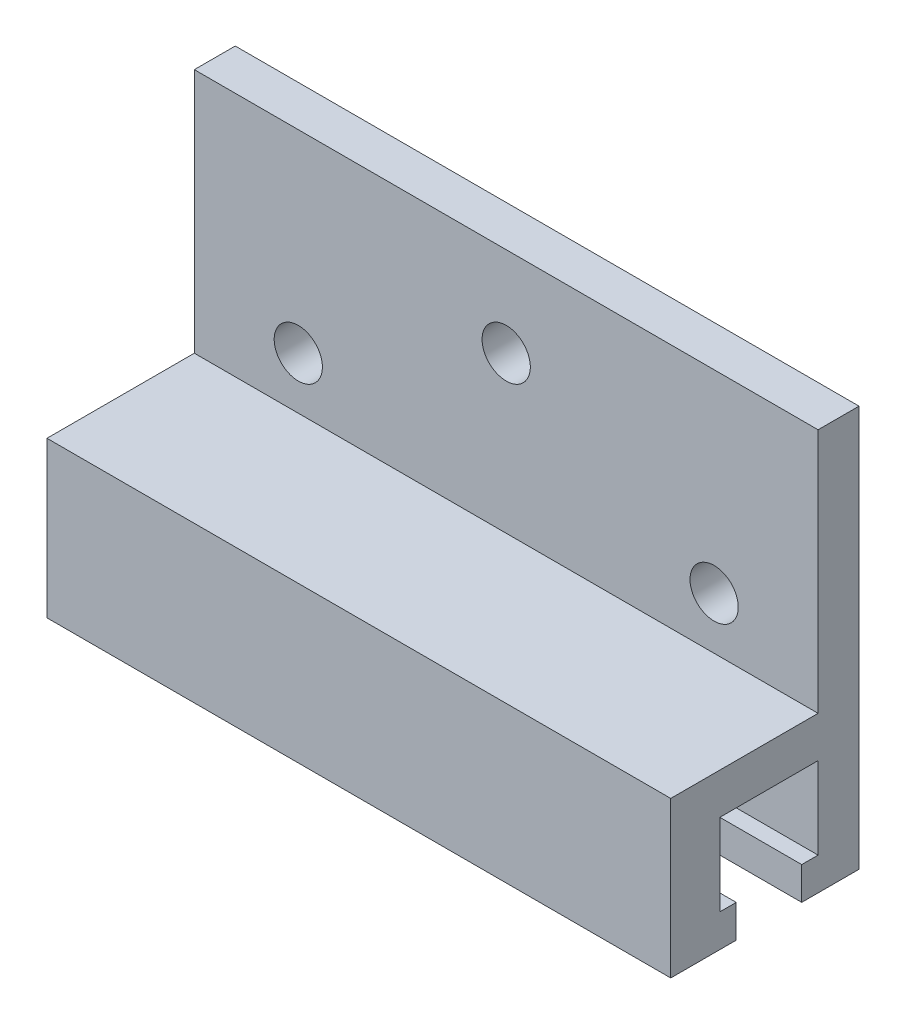
ISO-10303-21;
HEADER;
FILE_DESCRIPTION(('STEP AP214'),'2;1');
FILE_NAME('part.step','',(''),(''),'','','');
FILE_SCHEMA(('AUTOMOTIVE_DESIGN { 1 0 10303 214 1 1 1 1 }'));
ENDSEC;
DATA;
#1=APPLICATION_CONTEXT('core data for automotive mechanical design processes');
#2=APPLICATION_PROTOCOL_DEFINITION('international standard','automotive_design',2000,#1);
#3=PRODUCT_CONTEXT('',#1,'mechanical');
#4=PRODUCT('Part','Part','',(#3));
#5=PRODUCT_RELATED_PRODUCT_CATEGORY('part','',(#4));
#6=PRODUCT_DEFINITION_FORMATION('','',#4);
#7=PRODUCT_DEFINITION_CONTEXT('part definition',#1,'design');
#8=PRODUCT_DEFINITION('design','',#6,#7);
#9=PRODUCT_DEFINITION_SHAPE('','',#8);
#10=(LENGTH_UNIT() NAMED_UNIT(*) SI_UNIT(.MILLI.,.METRE.));
#11=(NAMED_UNIT(*) PLANE_ANGLE_UNIT() SI_UNIT($,.RADIAN.));
#12=(NAMED_UNIT(*) SI_UNIT($,.STERADIAN.) SOLID_ANGLE_UNIT());
#13=UNCERTAINTY_MEASURE_WITH_UNIT(LENGTH_MEASURE(1.E-05),#10,'distance_accuracy_value','');
#14=(GEOMETRIC_REPRESENTATION_CONTEXT(3) GLOBAL_UNCERTAINTY_ASSIGNED_CONTEXT((#13)) GLOBAL_UNIT_ASSIGNED_CONTEXT((#10,
#11,#12)) REPRESENTATION_CONTEXT('',''));
#15=CARTESIAN_POINT('',(0.,0.,0.));
#16=DIRECTION('',(0.,0.,1.));
#17=DIRECTION('',(1.,0.,0.));
#18=AXIS2_PLACEMENT_3D('',#15,#16,#17);
#19=CARTESIAN_POINT('',(38.1,-2.5,-2.));
#20=DIRECTION('',(0.,-1.,0.));
#21=DIRECTION('',(0.,0.,-1.));
#22=AXIS2_PLACEMENT_3D('',#19,#20,#21);
#23=PLANE('',#22);
#24=DIRECTION('',(0.,0.,1.));
#25=VECTOR('',#24,1.);
#26=CARTESIAN_POINT('',(0.,-2.5,-2.));
#27=LINE('',#26,#25);
#28=CARTESIAN_POINT('',(0.,-2.5,-3.));
#29=VERTEX_POINT('',#28);
#30=CARTESIAN_POINT('',(0.,-2.5,-2.));
#31=VERTEX_POINT('',#30);
#32=EDGE_CURVE('E168',#29,#31,#27,.T.);
#33=ORIENTED_EDGE('',*,*,#32,.T.);
#34=DIRECTION('',(-1.,0.,0.));
#35=VECTOR('',#34,1.);
#36=CARTESIAN_POINT('',(38.1,-2.5,-2.));
#37=LINE('',#36,#35);
#38=CARTESIAN_POINT('',(38.1,-2.5,-2.));
#39=VERTEX_POINT('',#38);
#40=EDGE_CURVE('E11',#39,#31,#37,.T.);
#41=ORIENTED_EDGE('',*,*,#40,.F.);
#42=DIRECTION('',(0.,0.,1.));
#43=VECTOR('',#42,1.);
#44=CARTESIAN_POINT('',(38.1,-2.5,-2.));
#45=LINE('',#44,#43);
#46=CARTESIAN_POINT('',(38.1,-2.5,-3.));
#47=VERTEX_POINT('',#46);
#48=EDGE_CURVE('E196',#47,#39,#45,.T.);
#49=ORIENTED_EDGE('',*,*,#48,.F.);
#50=DIRECTION('',(-1.,0.,0.));
#51=VECTOR('',#50,1.);
#52=CARTESIAN_POINT('',(38.1,-2.5,-3.));
#53=LINE('',#52,#51);
#54=EDGE_CURVE('E164',#47,#29,#53,.T.);
#55=ORIENTED_EDGE('',*,*,#54,.T.);
#56=EDGE_LOOP('',(#33,#41,#49,#55));
#57=FACE_BOUND('',#56,.T.);
#58=ADVANCED_FACE('F34',(#57),#23,.F.);
#59=CARTESIAN_POINT('',(38.1,-2.5,-2.));
#60=DIRECTION('',(0.,0.,-1.));
#61=DIRECTION('',(-1.,0.,0.));
#62=AXIS2_PLACEMENT_3D('',#59,#60,#61);
#63=PLANE('',#62);
#64=DIRECTION('',(0.,-1.,0.));
#65=VECTOR('',#64,1.);
#66=CARTESIAN_POINT('',(0.,-2.5,-2.));
#67=LINE('',#66,#65);
#68=CARTESIAN_POINT('',(0.,-4.5,-2.));
#69=VERTEX_POINT('',#68);
#70=EDGE_CURVE('E171',#31,#69,#67,.T.);
#71=ORIENTED_EDGE('',*,*,#70,.T.);
#72=DIRECTION('',(-1.,0.,0.));
#73=VECTOR('',#72,1.);
#74=CARTESIAN_POINT('',(38.1,-4.5,-2.));
#75=LINE('',#74,#73);
#76=CARTESIAN_POINT('',(38.1,-4.5,-2.));
#77=VERTEX_POINT('',#76);
#78=EDGE_CURVE('E43',#77,#69,#75,.T.);
#79=ORIENTED_EDGE('',*,*,#78,.F.);
#80=DIRECTION('',(0.,-1.,0.));
#81=VECTOR('',#80,1.);
#82=CARTESIAN_POINT('',(38.1,-2.5,-2.));
#83=LINE('',#82,#81);
#84=EDGE_CURVE('E113',#39,#77,#83,.T.);
#85=ORIENTED_EDGE('',*,*,#84,.F.);
#86=ORIENTED_EDGE('',*,*,#40,.T.);
#87=EDGE_LOOP('',(#71,#79,#85,#86));
#88=FACE_BOUND('',#87,.T.);
#89=ADVANCED_FACE('F288',(#88),#63,.F.);
#90=CARTESIAN_POINT('',(38.1,-4.5,-2.));
#91=DIRECTION('',(0.,1.,0.));
#92=DIRECTION('',(0.,0.,1.));
#93=AXIS2_PLACEMENT_3D('',#90,#91,#92);
#94=PLANE('',#93);
#95=DIRECTION('',(0.,0.,-1.));
#96=VECTOR('',#95,1.);
#97=CARTESIAN_POINT('',(0.,-4.5,-2.));
#98=LINE('',#97,#96);
#99=CARTESIAN_POINT('',(0.,-4.5,-5.5));
#100=VERTEX_POINT('',#99);
#101=EDGE_CURVE('E174',#69,#100,#98,.T.);
#102=ORIENTED_EDGE('',*,*,#101,.T.);
#103=DIRECTION('',(-1.,0.,0.));
#104=VECTOR('',#103,1.);
#105=CARTESIAN_POINT('',(38.1,-4.5,-5.5));
#106=LINE('',#105,#104);
#107=CARTESIAN_POINT('',(38.1,-4.5,-5.5));
#108=VERTEX_POINT('',#107);
#109=EDGE_CURVE('E221',#108,#100,#106,.T.);
#110=ORIENTED_EDGE('',*,*,#109,.F.);
#111=DIRECTION('',(0.,0.,-1.));
#112=VECTOR('',#111,1.);
#113=CARTESIAN_POINT('',(38.1,-4.5,-2.));
#114=LINE('',#113,#112);
#115=EDGE_CURVE('E245',#77,#108,#114,.T.);
#116=ORIENTED_EDGE('',*,*,#115,.F.);
#117=ORIENTED_EDGE('',*,*,#78,.T.);
#118=EDGE_LOOP('',(#102,#110,#116,#117));
#119=FACE_BOUND('',#118,.T.);
#120=ADVANCED_FACE('F292',(#119),#94,.F.);
#121=CARTESIAN_POINT('',(38.1,20.,-5.5));
#122=DIRECTION('',(0.,0.,1.));
#123=DIRECTION('',(0.,-1.,0.));
#124=AXIS2_PLACEMENT_3D('',#121,#122,#123);
#125=PLANE('',#124);
#126=CARTESIAN_POINT('',(19.05,14.525,-5.5));
#127=DIRECTION('',(0.,0.,-1.));
#128=DIRECTION('',(0.,1.,0.));
#129=AXIS2_PLACEMENT_3D('',#126,#127,#128);
#130=CIRCLE('',#129,1.47319999999999);
#131=CARTESIAN_POINT('',(19.05,15.9982,-5.5));
#132=VERTEX_POINT('',#131);
#133=EDGE_CURVE('E238',#132,#132,#130,.T.);
#134=ORIENTED_EDGE('',*,*,#133,.F.);
#135=EDGE_LOOP('',(#134));
#136=FACE_BOUND('',#135,.T.);
#137=CARTESIAN_POINT('',(31.75,8.175,-5.5));
#138=DIRECTION('',(0.,0.,-1.));
#139=DIRECTION('',(0.,1.,0.));
#140=AXIS2_PLACEMENT_3D('',#137,#138,#139);
#141=CIRCLE('',#140,1.47319999999999);
#142=CARTESIAN_POINT('',(31.75,9.64819999999999,-5.5));
#143=VERTEX_POINT('',#142);
#144=EDGE_CURVE('E228',#143,#143,#141,.T.);
#145=ORIENTED_EDGE('',*,*,#144,.F.);
#146=EDGE_LOOP('',(#145));
#147=FACE_BOUND('',#146,.T.);
#148=CARTESIAN_POINT('',(6.35,8.175,-5.5));
#149=DIRECTION('',(0.,0.,-1.));
#150=DIRECTION('',(0.,1.,0.));
#151=AXIS2_PLACEMENT_3D('',#148,#149,#150);
#152=CIRCLE('',#151,1.47319999999999);
#153=CARTESIAN_POINT('',(6.35,9.64819999999999,-5.5));
#154=VERTEX_POINT('',#153);
#155=EDGE_CURVE('E227',#154,#154,#152,.T.);
#156=ORIENTED_EDGE('',*,*,#155,.F.);
#157=EDGE_LOOP('',(#156));
#158=FACE_BOUND('',#157,.T.);
#159=DIRECTION('',(0.,1.,0.));
#160=VECTOR('',#159,1.);
#161=CARTESIAN_POINT('',(0.,20.,-5.5));
#162=LINE('',#161,#160);
#163=CARTESIAN_POINT('',(0.,20.,-5.5));
#164=VERTEX_POINT('',#163);
#165=EDGE_CURVE('E177',#100,#164,#162,.T.);
#166=ORIENTED_EDGE('',*,*,#165,.T.);
#167=DIRECTION('',(-1.,0.,0.));
#168=VECTOR('',#167,1.);
#169=CARTESIAN_POINT('',(38.1,20.,-5.5));
#170=LINE('',#169,#168);
#171=CARTESIAN_POINT('',(38.1,20.,-5.5));
#172=VERTEX_POINT('',#171);
#173=EDGE_CURVE('E218',#172,#164,#170,.T.);
#174=ORIENTED_EDGE('',*,*,#173,.F.);
#175=DIRECTION('',(0.,1.,0.));
#176=VECTOR('',#175,1.);
#177=CARTESIAN_POINT('',(38.1,4.58333333333333,-5.5));
#178=LINE('',#177,#176);
#179=EDGE_CURVE('E247',#108,#172,#178,.T.);
#180=ORIENTED_EDGE('',*,*,#179,.F.);
#181=ORIENTED_EDGE('',*,*,#109,.T.);
#182=EDGE_LOOP('',(#166,#174,#180,#181));
#183=FACE_BOUND('',#182,.T.);
#184=ADVANCED_FACE('F296',(#136,#147,#158,#183),#125,.F.);
#185=CARTESIAN_POINT('',(38.1,20.,-3.));
#186=DIRECTION('',(0.,-1.,0.));
#187=DIRECTION('',(0.,0.,-1.));
#188=AXIS2_PLACEMENT_3D('',#185,#186,#187);
#189=PLANE('',#188);
#190=DIRECTION('',(0.,0.,1.));
#191=VECTOR('',#190,1.);
#192=CARTESIAN_POINT('',(0.,20.,-3.));
#193=LINE('',#192,#191);
#194=CARTESIAN_POINT('',(0.,20.,-3.));
#195=VERTEX_POINT('',#194);
#196=EDGE_CURVE('E179',#164,#195,#193,.T.);
#197=ORIENTED_EDGE('',*,*,#196,.T.);
#198=DIRECTION('',(-1.,0.,0.));
#199=VECTOR('',#198,1.);
#200=CARTESIAN_POINT('',(38.1,20.,-3.));
#201=LINE('',#200,#199);
#202=CARTESIAN_POINT('',(38.1,20.,-3.));
#203=VERTEX_POINT('',#202);
#204=EDGE_CURVE('E215',#203,#195,#201,.T.);
#205=ORIENTED_EDGE('',*,*,#204,.F.);
#206=DIRECTION('',(0.,0.,1.));
#207=VECTOR('',#206,1.);
#208=CARTESIAN_POINT('',(38.1,20.,-3.));
#209=LINE('',#208,#207);
#210=EDGE_CURVE('E249',#172,#203,#209,.T.);
#211=ORIENTED_EDGE('',*,*,#210,.F.);
#212=ORIENTED_EDGE('',*,*,#173,.T.);
#213=EDGE_LOOP('',(#197,#205,#211,#212));
#214=FACE_BOUND('',#213,.T.);
#215=ADVANCED_FACE('F302',(#214),#189,.F.);
#216=CARTESIAN_POINT('',(38.1,5.,-3.));
#217=DIRECTION('',(0.,0.,-1.));
#218=DIRECTION('',(-1.,0.,0.));
#219=AXIS2_PLACEMENT_3D('',#216,#217,#218);
#220=PLANE('',#219);
#221=CARTESIAN_POINT('',(19.05,14.525,-3.));
#222=DIRECTION('',(0.,0.,-1.));
#223=DIRECTION('',(-1.,0.,0.));
#224=AXIS2_PLACEMENT_3D('',#221,#222,#223);
#225=CIRCLE('',#224,1.47319999999999);
#226=CARTESIAN_POINT('',(17.5768,14.525,-3.));
#227=VERTEX_POINT('',#226);
#228=EDGE_CURVE('E37',#227,#227,#225,.T.);
#229=ORIENTED_EDGE('',*,*,#228,.T.);
#230=EDGE_LOOP('',(#229));
#231=FACE_BOUND('',#230,.T.);
#232=CARTESIAN_POINT('',(31.75,8.175,-3.));
#233=DIRECTION('',(0.,0.,-1.));
#234=DIRECTION('',(-1.,0.,0.));
#235=AXIS2_PLACEMENT_3D('',#232,#233,#234);
#236=CIRCLE('',#235,1.47319999999999);
#237=CARTESIAN_POINT('',(30.2768,8.175,-3.));
#238=VERTEX_POINT('',#237);
#239=EDGE_CURVE('E225',#238,#238,#236,.T.);
#240=ORIENTED_EDGE('',*,*,#239,.T.);
#241=EDGE_LOOP('',(#240));
#242=FACE_BOUND('',#241,.T.);
#243=CARTESIAN_POINT('',(6.35,8.175,-3.));
#244=DIRECTION('',(0.,0.,-1.));
#245=DIRECTION('',(-1.,0.,0.));
#246=AXIS2_PLACEMENT_3D('',#243,#244,#245);
#247=CIRCLE('',#246,1.47319999999999);
#248=CARTESIAN_POINT('',(4.87680000000001,8.175,-3.));
#249=VERTEX_POINT('',#248);
#250=EDGE_CURVE('E172',#249,#249,#247,.T.);
#251=ORIENTED_EDGE('',*,*,#250,.T.);
#252=EDGE_LOOP('',(#251));
#253=FACE_BOUND('',#252,.T.);
#254=DIRECTION('',(0.,-1.,0.));
#255=VECTOR('',#254,1.);
#256=CARTESIAN_POINT('',(0.,5.,-3.));
#257=LINE('',#256,#255);
#258=CARTESIAN_POINT('',(0.,5.,-3.));
#259=VERTEX_POINT('',#258);
#260=EDGE_CURVE('E181',#195,#259,#257,.T.);
#261=ORIENTED_EDGE('',*,*,#260,.T.);
#262=DIRECTION('',(-1.,0.,0.));
#263=VECTOR('',#262,1.);
#264=CARTESIAN_POINT('',(38.1,5.,-3.));
#265=LINE('',#264,#263);
#266=CARTESIAN_POINT('',(38.1,5.,-3.));
#267=VERTEX_POINT('',#266);
#268=EDGE_CURVE('E212',#267,#259,#265,.T.);
#269=ORIENTED_EDGE('',*,*,#268,.F.);
#270=DIRECTION('',(0.,-1.,0.));
#271=VECTOR('',#270,1.);
#272=CARTESIAN_POINT('',(38.1,5.,-3.));
#273=LINE('',#272,#271);
#274=EDGE_CURVE('E251',#203,#267,#273,.T.);
#275=ORIENTED_EDGE('',*,*,#274,.F.);
#276=ORIENTED_EDGE('',*,*,#204,.T.);
#277=EDGE_LOOP('',(#261,#269,#275,#276));
#278=FACE_BOUND('',#277,.T.);
#279=ADVANCED_FACE('F306',(#231,#242,#253,#278),#220,.F.);
#280=CARTESIAN_POINT('',(38.1,5.,6.));
#281=DIRECTION('',(0.,-1.,0.));
#282=DIRECTION('',(0.,0.,-1.));
#283=AXIS2_PLACEMENT_3D('',#280,#281,#282);
#284=PLANE('',#283);
#285=DIRECTION('',(0.,0.,1.));
#286=VECTOR('',#285,1.);
#287=CARTESIAN_POINT('',(0.,5.,6.));
#288=LINE('',#287,#286);
#289=CARTESIAN_POINT('',(0.,5.,6.));
#290=VERTEX_POINT('',#289);
#291=EDGE_CURVE('E183',#259,#290,#288,.T.);
#292=ORIENTED_EDGE('',*,*,#291,.T.);
#293=DIRECTION('',(-1.,0.,0.));
#294=VECTOR('',#293,1.);
#295=CARTESIAN_POINT('',(38.1,5.,6.));
#296=LINE('',#295,#294);
#297=CARTESIAN_POINT('',(38.1,5.,6.));
#298=VERTEX_POINT('',#297);
#299=EDGE_CURVE('E209',#298,#290,#296,.T.);
#300=ORIENTED_EDGE('',*,*,#299,.F.);
#301=DIRECTION('',(0.,0.,1.));
#302=VECTOR('',#301,1.);
#303=CARTESIAN_POINT('',(38.1,5.,6.));
#304=LINE('',#303,#302);
#305=EDGE_CURVE('E253',#267,#298,#304,.T.);
#306=ORIENTED_EDGE('',*,*,#305,.F.);
#307=ORIENTED_EDGE('',*,*,#268,.T.);
#308=EDGE_LOOP('',(#292,#300,#306,#307));
#309=FACE_BOUND('',#308,.T.);
#310=ADVANCED_FACE('F310',(#309),#284,.F.);
#311=CARTESIAN_POINT('',(38.1,5.,6.));
#312=DIRECTION('',(0.,0.,-1.));
#313=DIRECTION('',(0.,1.,0.));
#314=AXIS2_PLACEMENT_3D('',#311,#312,#313);
#315=PLANE('',#314);
#316=DIRECTION('',(0.,-1.,0.));
#317=VECTOR('',#316,1.);
#318=CARTESIAN_POINT('',(0.,5.,6.));
#319=LINE('',#318,#317);
#320=CARTESIAN_POINT('',(0.,-4.5,6.));
#321=VERTEX_POINT('',#320);
#322=EDGE_CURVE('E185',#290,#321,#319,.T.);
#323=ORIENTED_EDGE('',*,*,#322,.T.);
#324=DIRECTION('',(-1.,0.,0.));
#325=VECTOR('',#324,1.);
#326=CARTESIAN_POINT('',(38.1,-4.5,6.));
#327=LINE('',#326,#325);
#328=CARTESIAN_POINT('',(38.1,-4.5,6.));
#329=VERTEX_POINT('',#328);
#330=EDGE_CURVE('E206',#329,#321,#327,.T.);
#331=ORIENTED_EDGE('',*,*,#330,.F.);
#332=DIRECTION('',(0.,-1.,0.));
#333=VECTOR('',#332,1.);
#334=CARTESIAN_POINT('',(38.1,5.,6.));
#335=LINE('',#334,#333);
#336=EDGE_CURVE('E255',#298,#329,#335,.T.);
#337=ORIENTED_EDGE('',*,*,#336,.F.);
#338=ORIENTED_EDGE('',*,*,#299,.T.);
#339=EDGE_LOOP('',(#323,#331,#337,#338));
#340=FACE_BOUND('',#339,.T.);
#341=ADVANCED_FACE('F314',(#340),#315,.F.);
#342=CARTESIAN_POINT('',(38.1,-4.5,6.));
#343=DIRECTION('',(0.,1.,0.));
#344=DIRECTION('',(0.,0.,1.));
#345=AXIS2_PLACEMENT_3D('',#342,#343,#344);
#346=PLANE('',#345);
#347=DIRECTION('',(0.,0.,-1.));
#348=VECTOR('',#347,1.);
#349=CARTESIAN_POINT('',(0.,-4.5,6.));
#350=LINE('',#349,#348);
#351=CARTESIAN_POINT('',(0.,-4.5,2.));
#352=VERTEX_POINT('',#351);
#353=EDGE_CURVE('E187',#321,#352,#350,.T.);
#354=ORIENTED_EDGE('',*,*,#353,.T.);
#355=DIRECTION('',(-1.,0.,0.));
#356=VECTOR('',#355,1.);
#357=CARTESIAN_POINT('',(38.1,-4.5,2.));
#358=LINE('',#357,#356);
#359=CARTESIAN_POINT('',(38.1,-4.5,2.));
#360=VERTEX_POINT('',#359);
#361=EDGE_CURVE('E203',#360,#352,#358,.T.);
#362=ORIENTED_EDGE('',*,*,#361,.F.);
#363=DIRECTION('',(0.,0.,-1.));
#364=VECTOR('',#363,1.);
#365=CARTESIAN_POINT('',(38.1,-4.5,6.));
#366=LINE('',#365,#364);
#367=EDGE_CURVE('E257',#329,#360,#366,.T.);
#368=ORIENTED_EDGE('',*,*,#367,.F.);
#369=ORIENTED_EDGE('',*,*,#330,.T.);
#370=EDGE_LOOP('',(#354,#362,#368,#369));
#371=FACE_BOUND('',#370,.T.);
#372=ADVANCED_FACE('F318',(#371),#346,.F.);
#373=CARTESIAN_POINT('',(38.1,-2.5,2.));
#374=DIRECTION('',(0.,0.,1.));
#375=DIRECTION('',(1.,0.,0.));
#376=AXIS2_PLACEMENT_3D('',#373,#374,#375);
#377=PLANE('',#376);
#378=DIRECTION('',(0.,1.,0.));
#379=VECTOR('',#378,1.);
#380=CARTESIAN_POINT('',(0.,-2.5,2.));
#381=LINE('',#380,#379);
#382=CARTESIAN_POINT('',(0.,-2.5,2.));
#383=VERTEX_POINT('',#382);
#384=EDGE_CURVE('E189',#352,#383,#381,.T.);
#385=ORIENTED_EDGE('',*,*,#384,.T.);
#386=DIRECTION('',(-1.,0.,0.));
#387=VECTOR('',#386,1.);
#388=CARTESIAN_POINT('',(38.1,-2.5,2.));
#389=LINE('',#388,#387);
#390=CARTESIAN_POINT('',(38.1,-2.5,2.));
#391=VERTEX_POINT('',#390);
#392=EDGE_CURVE('E200',#391,#383,#389,.T.);
#393=ORIENTED_EDGE('',*,*,#392,.F.);
#394=DIRECTION('',(0.,1.,0.));
#395=VECTOR('',#394,1.);
#396=CARTESIAN_POINT('',(38.1,-2.5,2.));
#397=LINE('',#396,#395);
#398=EDGE_CURVE('E259',#360,#391,#397,.T.);
#399=ORIENTED_EDGE('',*,*,#398,.F.);
#400=ORIENTED_EDGE('',*,*,#361,.T.);
#401=EDGE_LOOP('',(#385,#393,#399,#400));
#402=FACE_BOUND('',#401,.T.);
#403=ADVANCED_FACE('F265',(#402),#377,.F.);
#404=CARTESIAN_POINT('',(38.1,-2.5,3.));
#405=DIRECTION('',(0.,-1.,0.));
#406=DIRECTION('',(0.,0.,-1.));
#407=AXIS2_PLACEMENT_3D('',#404,#405,#406);
#408=PLANE('',#407);
#409=DIRECTION('',(0.,0.,1.));
#410=VECTOR('',#409,1.);
#411=CARTESIAN_POINT('',(0.,-2.5,3.));
#412=LINE('',#411,#410);
#413=CARTESIAN_POINT('',(0.,-2.5,3.));
#414=VERTEX_POINT('',#413);
#415=EDGE_CURVE('E191',#383,#414,#412,.T.);
#416=ORIENTED_EDGE('',*,*,#415,.T.);
#417=DIRECTION('',(-1.,0.,0.));
#418=VECTOR('',#417,1.);
#419=CARTESIAN_POINT('',(38.1,-2.5,3.));
#420=LINE('',#419,#418);
#421=CARTESIAN_POINT('',(38.1,-2.5,3.));
#422=VERTEX_POINT('',#421);
#423=EDGE_CURVE('E159',#422,#414,#420,.T.);
#424=ORIENTED_EDGE('',*,*,#423,.F.);
#425=DIRECTION('',(0.,0.,1.));
#426=VECTOR('',#425,1.);
#427=CARTESIAN_POINT('',(38.1,-2.5,3.));
#428=LINE('',#427,#426);
#429=EDGE_CURVE('E150',#391,#422,#428,.T.);
#430=ORIENTED_EDGE('',*,*,#429,.F.);
#431=ORIENTED_EDGE('',*,*,#392,.T.);
#432=EDGE_LOOP('',(#416,#424,#430,#431));
#433=FACE_BOUND('',#432,.T.);
#434=ADVANCED_FACE('F269',(#433),#408,.F.);
#435=CARTESIAN_POINT('',(38.1,2.5,3.));
#436=DIRECTION('',(0.,0.,1.));
#437=DIRECTION('',(0.,-1.,0.));
#438=AXIS2_PLACEMENT_3D('',#435,#436,#437);
#439=PLANE('',#438);
#440=DIRECTION('',(0.,1.,0.));
#441=VECTOR('',#440,1.);
#442=CARTESIAN_POINT('',(0.,2.5,3.));
#443=LINE('',#442,#441);
#444=CARTESIAN_POINT('',(0.,2.5,3.));
#445=VERTEX_POINT('',#444);
#446=EDGE_CURVE('E158',#414,#445,#443,.T.);
#447=ORIENTED_EDGE('',*,*,#446,.T.);
#448=DIRECTION('',(-1.,0.,0.));
#449=VECTOR('',#448,1.);
#450=CARTESIAN_POINT('',(38.1,2.5,3.));
#451=LINE('',#450,#449);
#452=CARTESIAN_POINT('',(38.1,2.5,3.));
#453=VERTEX_POINT('',#452);
#454=EDGE_CURVE('E155',#453,#445,#451,.T.);
#455=ORIENTED_EDGE('',*,*,#454,.F.);
#456=DIRECTION('',(0.,1.,0.));
#457=VECTOR('',#456,1.);
#458=CARTESIAN_POINT('',(38.1,2.5,3.));
#459=LINE('',#458,#457);
#460=EDGE_CURVE('E144',#422,#453,#459,.T.);
#461=ORIENTED_EDGE('',*,*,#460,.F.);
#462=ORIENTED_EDGE('',*,*,#423,.T.);
#463=EDGE_LOOP('',(#447,#455,#461,#462));
#464=FACE_BOUND('',#463,.T.);
#465=ADVANCED_FACE('F156',(#464),#439,.F.);
#466=CARTESIAN_POINT('',(38.1,2.5,3.));
#467=DIRECTION('',(0.,1.,0.));
#468=DIRECTION('',(0.,0.,1.));
#469=AXIS2_PLACEMENT_3D('',#466,#467,#468);
#470=PLANE('',#469);
#471=DIRECTION('',(0.,0.,-1.));
#472=VECTOR('',#471,1.);
#473=CARTESIAN_POINT('',(0.,2.5,3.));
#474=LINE('',#473,#472);
#475=CARTESIAN_POINT('',(0.,2.5,-3.));
#476=VERTEX_POINT('',#475);
#477=EDGE_CURVE('E99',#445,#476,#474,.T.);
#478=ORIENTED_EDGE('',*,*,#477,.T.);
#479=DIRECTION('',(-1.,0.,0.));
#480=VECTOR('',#479,1.);
#481=CARTESIAN_POINT('',(38.1,2.5,-3.));
#482=LINE('',#481,#480);
#483=CARTESIAN_POINT('',(38.1,2.5,-3.));
#484=VERTEX_POINT('',#483);
#485=EDGE_CURVE('E160',#484,#476,#482,.T.);
#486=ORIENTED_EDGE('',*,*,#485,.F.);
#487=DIRECTION('',(0.,0.,-1.));
#488=VECTOR('',#487,1.);
#489=CARTESIAN_POINT('',(38.1,2.5,3.));
#490=LINE('',#489,#488);
#491=EDGE_CURVE('E148',#453,#484,#490,.T.);
#492=ORIENTED_EDGE('',*,*,#491,.F.);
#493=ORIENTED_EDGE('',*,*,#454,.T.);
#494=EDGE_LOOP('',(#478,#486,#492,#493));
#495=FACE_BOUND('',#494,.T.);
#496=ADVANCED_FACE('F162',(#495),#470,.F.);
#497=CARTESIAN_POINT('',(38.1,2.5,-3.));
#498=DIRECTION('',(0.,0.,-1.));
#499=DIRECTION('',(0.,1.,0.));
#500=AXIS2_PLACEMENT_3D('',#497,#498,#499);
#501=PLANE('',#500);
#502=DIRECTION('',(0.,-1.,0.));
#503=VECTOR('',#502,1.);
#504=CARTESIAN_POINT('',(0.,2.5,-3.));
#505=LINE('',#504,#503);
#506=EDGE_CURVE('E105',#476,#29,#505,.T.);
#507=ORIENTED_EDGE('',*,*,#506,.T.);
#508=ORIENTED_EDGE('',*,*,#54,.F.);
#509=DIRECTION('',(0.,-1.,0.));
#510=VECTOR('',#509,1.);
#511=CARTESIAN_POINT('',(38.1,2.5,-3.));
#512=LINE('',#511,#510);
#513=EDGE_CURVE('E52',#484,#47,#512,.T.);
#514=ORIENTED_EDGE('',*,*,#513,.F.);
#515=ORIENTED_EDGE('',*,*,#485,.T.);
#516=EDGE_LOOP('',(#507,#508,#514,#515));
#517=FACE_BOUND('',#516,.T.);
#518=ADVANCED_FACE('F277',(#517),#501,.F.);
#519=CARTESIAN_POINT('',(38.1,0.,0.));
#520=DIRECTION('',(-1.,0.,0.));
#521=DIRECTION('',(0.,0.,1.));
#522=AXIS2_PLACEMENT_3D('',#519,#520,#521);
#523=PLANE('',#522);
#524=ORIENTED_EDGE('',*,*,#48,.T.);
#525=ORIENTED_EDGE('',*,*,#84,.T.);
#526=ORIENTED_EDGE('',*,*,#115,.T.);
#527=ORIENTED_EDGE('',*,*,#179,.T.);
#528=ORIENTED_EDGE('',*,*,#210,.T.);
#529=ORIENTED_EDGE('',*,*,#274,.T.);
#530=ORIENTED_EDGE('',*,*,#305,.T.);
#531=ORIENTED_EDGE('',*,*,#336,.T.);
#532=ORIENTED_EDGE('',*,*,#367,.T.);
#533=ORIENTED_EDGE('',*,*,#398,.T.);
#534=ORIENTED_EDGE('',*,*,#429,.T.);
#535=ORIENTED_EDGE('',*,*,#460,.T.);
#536=ORIENTED_EDGE('',*,*,#491,.T.);
#537=ORIENTED_EDGE('',*,*,#513,.T.);
#538=EDGE_LOOP('',(#524,#525,#526,#527,#528,#529,#530,#531,#532,#533,#534,#535,#536,#537));
#539=FACE_BOUND('',#538,.T.);
#540=ADVANCED_FACE('F146',(#539),#523,.F.);
#541=CARTESIAN_POINT('',(0.,0.,0.));
#542=DIRECTION('',(-1.,0.,0.));
#543=DIRECTION('',(0.,0.,1.));
#544=AXIS2_PLACEMENT_3D('',#541,#542,#543);
#545=PLANE('',#544);
#546=ORIENTED_EDGE('',*,*,#32,.F.);
#547=ORIENTED_EDGE('',*,*,#506,.F.);
#548=ORIENTED_EDGE('',*,*,#477,.F.);
#549=ORIENTED_EDGE('',*,*,#446,.F.);
#550=ORIENTED_EDGE('',*,*,#415,.F.);
#551=ORIENTED_EDGE('',*,*,#384,.F.);
#552=ORIENTED_EDGE('',*,*,#353,.F.);
#553=ORIENTED_EDGE('',*,*,#322,.F.);
#554=ORIENTED_EDGE('',*,*,#291,.F.);
#555=ORIENTED_EDGE('',*,*,#260,.F.);
#556=ORIENTED_EDGE('',*,*,#196,.F.);
#557=ORIENTED_EDGE('',*,*,#165,.F.);
#558=ORIENTED_EDGE('',*,*,#101,.F.);
#559=ORIENTED_EDGE('',*,*,#70,.F.);
#560=EDGE_LOOP('',(#546,#547,#548,#549,#550,#551,#552,#553,#554,#555,#556,#557,#558,#559));
#561=FACE_BOUND('',#560,.T.);
#562=ADVANCED_FACE('F272',(#561),#545,.T.);
#563=CARTESIAN_POINT('',(6.35,8.175,-5.5));
#564=DIRECTION('',(0.,0.,-1.));
#565=DIRECTION('',(0.,1.,0.));
#566=AXIS2_PLACEMENT_3D('',#563,#564,#565);
#567=CYLINDRICAL_SURFACE('',#566,1.47319999999999);
#568=ORIENTED_EDGE('',*,*,#155,.T.);
#569=EDGE_LOOP('',(#568));
#570=FACE_BOUND('',#569,.T.);
#571=ORIENTED_EDGE('',*,*,#250,.F.);
#572=EDGE_LOOP('',(#571));
#573=FACE_BOUND('',#572,.T.);
#574=ADVANCED_FACE('F354',(#570,#573),#567,.F.);
#575=CARTESIAN_POINT('',(31.75,8.175,-5.5));
#576=DIRECTION('',(0.,0.,-1.));
#577=DIRECTION('',(0.,1.,0.));
#578=AXIS2_PLACEMENT_3D('',#575,#576,#577);
#579=CYLINDRICAL_SURFACE('',#578,1.47319999999999);
#580=ORIENTED_EDGE('',*,*,#144,.T.);
#581=EDGE_LOOP('',(#580));
#582=FACE_BOUND('',#581,.T.);
#583=ORIENTED_EDGE('',*,*,#239,.F.);
#584=EDGE_LOOP('',(#583));
#585=FACE_BOUND('',#584,.T.);
#586=ADVANCED_FACE('F371',(#582,#585),#579,.F.);
#587=CARTESIAN_POINT('',(19.05,14.525,-5.5));
#588=DIRECTION('',(0.,0.,-1.));
#589=DIRECTION('',(0.,1.,0.));
#590=AXIS2_PLACEMENT_3D('',#587,#588,#589);
#591=CYLINDRICAL_SURFACE('',#590,1.47319999999999);
#592=ORIENTED_EDGE('',*,*,#133,.T.);
#593=EDGE_LOOP('',(#592));
#594=FACE_BOUND('',#593,.T.);
#595=ORIENTED_EDGE('',*,*,#228,.F.);
#596=EDGE_LOOP('',(#595));
#597=FACE_BOUND('',#596,.T.);
#598=ADVANCED_FACE('F381',(#594,#597),#591,.F.);
#599=CLOSED_SHELL('',(#58,#89,#120,#184,#215,#279,#310,#341,#372,#403,#434,#465,#496,#518,#540,
#562,#574,#586,#598));
#600=MANIFOLD_SOLID_BREP('B2',#599);
#601=ADVANCED_BREP_SHAPE_REPRESENTATION('',(#18,#600),#14);
#602=SHAPE_DEFINITION_REPRESENTATION(#9,#601);
ENDSEC;
END-ISO-10303-21;
